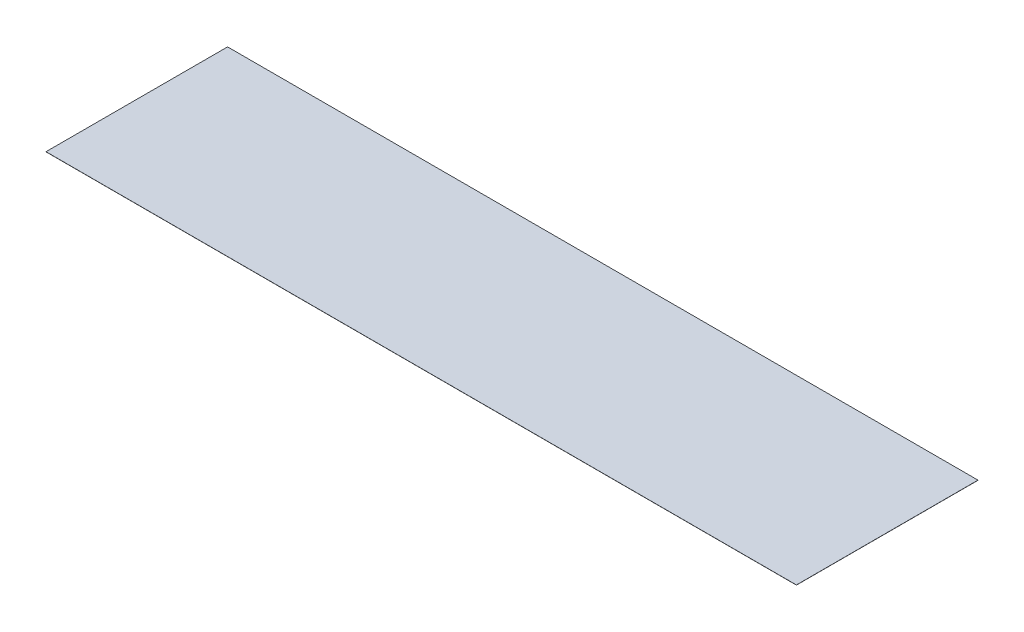
ISO-10303-21;
HEADER;
FILE_DESCRIPTION(('STEP AP214'),'2;1');
FILE_NAME('part.step','',(''),(''),'','','');
FILE_SCHEMA(('AUTOMOTIVE_DESIGN { 1 0 10303 214 1 1 1 1 }'));
ENDSEC;
DATA;
#1=APPLICATION_CONTEXT('core data for automotive mechanical design processes');
#2=APPLICATION_PROTOCOL_DEFINITION('international standard','automotive_design',2000,#1);
#3=PRODUCT_CONTEXT('',#1,'mechanical');
#4=PRODUCT('Part','Part','',(#3));
#5=PRODUCT_RELATED_PRODUCT_CATEGORY('part','',(#4));
#6=PRODUCT_DEFINITION_FORMATION('','',#4);
#7=PRODUCT_DEFINITION_CONTEXT('part definition',#1,'design');
#8=PRODUCT_DEFINITION('design','',#6,#7);
#9=PRODUCT_DEFINITION_SHAPE('','',#8);
#10=(LENGTH_UNIT() NAMED_UNIT(*) SI_UNIT(.MILLI.,.METRE.));
#11=(NAMED_UNIT(*) PLANE_ANGLE_UNIT() SI_UNIT($,.RADIAN.));
#12=(NAMED_UNIT(*) SI_UNIT($,.STERADIAN.) SOLID_ANGLE_UNIT());
#13=UNCERTAINTY_MEASURE_WITH_UNIT(LENGTH_MEASURE(1.E-05),#10,'distance_accuracy_value','');
#14=(GEOMETRIC_REPRESENTATION_CONTEXT(3) GLOBAL_UNCERTAINTY_ASSIGNED_CONTEXT((#13)) GLOBAL_UNIT_ASSIGNED_CONTEXT((#10,
#11,#12)) REPRESENTATION_CONTEXT('',''));
#15=CARTESIAN_POINT('',(0.,0.,0.));
#16=DIRECTION('',(0.,0.,1.));
#17=DIRECTION('',(1.,0.,0.));
#18=AXIS2_PLACEMENT_3D('',#15,#16,#17);
#19=CARTESIAN_POINT('',(0.,1.,-1219.2));
#20=DIRECTION('',(1.,0.,0.));
#21=DIRECTION('',(0.,0.,-1.));
#22=AXIS2_PLACEMENT_3D('',#19,#20,#21);
#23=PLANE('',#22);
#24=DIRECTION('',(0.,0.,1.));
#25=VECTOR('',#24,1.);
#26=CARTESIAN_POINT('',(0.,0.,-1219.2));
#27=LINE('',#26,#25);
#28=CARTESIAN_POINT('',(0.,0.,-1219.2));
#29=VERTEX_POINT('',#28);
#30=CARTESIAN_POINT('',(0.,0.,0.));
#31=VERTEX_POINT('',#30);
#32=EDGE_CURVE('E98',#29,#31,#27,.T.);
#33=ORIENTED_EDGE('',*,*,#32,.T.);
#34=DIRECTION('',(0.,-1.,0.));
#35=VECTOR('',#34,1.);
#36=CARTESIAN_POINT('',(0.,1.,0.));
#37=LINE('',#36,#35);
#38=CARTESIAN_POINT('',(0.,1.,0.));
#39=VERTEX_POINT('',#38);
#40=EDGE_CURVE('E11',#39,#31,#37,.T.);
#41=ORIENTED_EDGE('',*,*,#40,.F.);
#42=DIRECTION('',(0.,0.,1.));
#43=VECTOR('',#42,1.);
#44=CARTESIAN_POINT('',(0.,1.,-1219.2));
#45=LINE('',#44,#43);
#46=CARTESIAN_POINT('',(0.,1.,-1219.2));
#47=VERTEX_POINT('',#46);
#48=EDGE_CURVE('E86',#47,#39,#45,.T.);
#49=ORIENTED_EDGE('',*,*,#48,.F.);
#50=DIRECTION('',(0.,-1.,0.));
#51=VECTOR('',#50,1.);
#52=CARTESIAN_POINT('',(0.,1.,-1219.2));
#53=LINE('',#52,#51);
#54=EDGE_CURVE('E94',#47,#29,#53,.T.);
#55=ORIENTED_EDGE('',*,*,#54,.T.);
#56=EDGE_LOOP('',(#33,#41,#49,#55));
#57=FACE_BOUND('',#56,.T.);
#58=ADVANCED_FACE('F35',(#57),#23,.F.);
#59=CARTESIAN_POINT('',(0.,1.,0.));
#60=DIRECTION('',(0.,0.,-1.));
#61=DIRECTION('',(-1.,0.,0.));
#62=AXIS2_PLACEMENT_3D('',#59,#60,#61);
#63=PLANE('',#62);
#64=DIRECTION('',(1.,0.,0.));
#65=VECTOR('',#64,1.);
#66=CARTESIAN_POINT('',(0.,0.,0.));
#67=LINE('',#66,#65);
#68=CARTESIAN_POINT('',(5038.86075539473,0.,0.));
#69=VERTEX_POINT('',#68);
#70=EDGE_CURVE('E90',#31,#69,#67,.T.);
#71=ORIENTED_EDGE('',*,*,#70,.T.);
#72=DIRECTION('',(0.,-1.,0.));
#73=VECTOR('',#72,1.);
#74=CARTESIAN_POINT('',(5038.86075539473,1.,0.));
#75=LINE('',#74,#73);
#76=CARTESIAN_POINT('',(5038.86075539473,1.,0.));
#77=VERTEX_POINT('',#76);
#78=EDGE_CURVE('E43',#77,#69,#75,.T.);
#79=ORIENTED_EDGE('',*,*,#78,.F.);
#80=DIRECTION('',(1.,0.,0.));
#81=VECTOR('',#80,1.);
#82=CARTESIAN_POINT('',(0.,1.,0.));
#83=LINE('',#82,#81);
#84=EDGE_CURVE('E81',#39,#77,#83,.T.);
#85=ORIENTED_EDGE('',*,*,#84,.F.);
#86=ORIENTED_EDGE('',*,*,#40,.T.);
#87=EDGE_LOOP('',(#71,#79,#85,#86));
#88=FACE_BOUND('',#87,.T.);
#89=ADVANCED_FACE('F89',(#88),#63,.F.);
#90=CARTESIAN_POINT('',(5038.86075539473,1.,-1219.2));
#91=DIRECTION('',(-1.,0.,0.));
#92=DIRECTION('',(0.,0.,1.));
#93=AXIS2_PLACEMENT_3D('',#90,#91,#92);
#94=PLANE('',#93);
#95=DIRECTION('',(0.,0.,-1.));
#96=VECTOR('',#95,1.);
#97=CARTESIAN_POINT('',(5038.86075539473,0.,-1219.2));
#98=LINE('',#97,#96);
#99=CARTESIAN_POINT('',(5038.86075539473,0.,-1219.2));
#100=VERTEX_POINT('',#99);
#101=EDGE_CURVE('E68',#69,#100,#98,.T.);
#102=ORIENTED_EDGE('',*,*,#101,.T.);
#103=DIRECTION('',(0.,-1.,0.));
#104=VECTOR('',#103,1.);
#105=CARTESIAN_POINT('',(5038.86075539473,1.,-1219.2));
#106=LINE('',#105,#104);
#107=CARTESIAN_POINT('',(5038.86075539473,1.,-1219.2));
#108=VERTEX_POINT('',#107);
#109=EDGE_CURVE('E91',#108,#100,#106,.T.);
#110=ORIENTED_EDGE('',*,*,#109,.F.);
#111=DIRECTION('',(0.,0.,-1.));
#112=VECTOR('',#111,1.);
#113=CARTESIAN_POINT('',(5038.86075539473,1.,-1219.2));
#114=LINE('',#113,#112);
#115=EDGE_CURVE('E84',#77,#108,#114,.T.);
#116=ORIENTED_EDGE('',*,*,#115,.F.);
#117=ORIENTED_EDGE('',*,*,#78,.T.);
#118=EDGE_LOOP('',(#102,#110,#116,#117));
#119=FACE_BOUND('',#118,.T.);
#120=ADVANCED_FACE('F92',(#119),#94,.F.);
#121=CARTESIAN_POINT('',(0.,1.,-1219.2));
#122=DIRECTION('',(0.,0.,1.));
#123=DIRECTION('',(1.,0.,0.));
#124=AXIS2_PLACEMENT_3D('',#121,#122,#123);
#125=PLANE('',#124);
#126=DIRECTION('',(-1.,0.,0.));
#127=VECTOR('',#126,1.);
#128=CARTESIAN_POINT('',(0.,0.,-1219.2));
#129=LINE('',#128,#127);
#130=EDGE_CURVE('E74',#100,#29,#129,.T.);
#131=ORIENTED_EDGE('',*,*,#130,.T.);
#132=ORIENTED_EDGE('',*,*,#54,.F.);
#133=DIRECTION('',(-1.,0.,0.));
#134=VECTOR('',#133,1.);
#135=CARTESIAN_POINT('',(0.,1.,-1219.2));
#136=LINE('',#135,#134);
#137=EDGE_CURVE('E51',#108,#47,#136,.T.);
#138=ORIENTED_EDGE('',*,*,#137,.F.);
#139=ORIENTED_EDGE('',*,*,#109,.T.);
#140=EDGE_LOOP('',(#131,#132,#138,#139));
#141=FACE_BOUND('',#140,.T.);
#142=ADVANCED_FACE('F105',(#141),#125,.F.);
#143=CARTESIAN_POINT('',(0.,1.,0.));
#144=DIRECTION('',(0.,1.,0.));
#145=DIRECTION('',(0.,0.,1.));
#146=AXIS2_PLACEMENT_3D('',#143,#144,#145);
#147=PLANE('',#146);
#148=ORIENTED_EDGE('',*,*,#48,.T.);
#149=ORIENTED_EDGE('',*,*,#84,.T.);
#150=ORIENTED_EDGE('',*,*,#115,.T.);
#151=ORIENTED_EDGE('',*,*,#137,.T.);
#152=EDGE_LOOP('',(#148,#149,#150,#151));
#153=FACE_BOUND('',#152,.T.);
#154=ADVANCED_FACE('F82',(#153),#147,.T.);
#155=CARTESIAN_POINT('',(0.,0.,0.));
#156=DIRECTION('',(0.,1.,0.));
#157=DIRECTION('',(0.,0.,1.));
#158=AXIS2_PLACEMENT_3D('',#155,#156,#157);
#159=PLANE('',#158);
#160=ORIENTED_EDGE('',*,*,#32,.F.);
#161=ORIENTED_EDGE('',*,*,#130,.F.);
#162=ORIENTED_EDGE('',*,*,#101,.F.);
#163=ORIENTED_EDGE('',*,*,#70,.F.);
#164=EDGE_LOOP('',(#160,#161,#162,#163));
#165=FACE_BOUND('',#164,.T.);
#166=ADVANCED_FACE('F108',(#165),#159,.F.);
#167=CLOSED_SHELL('',(#58,#89,#120,#142,#154,#166));
#168=MANIFOLD_SOLID_BREP('B2',#167);
#169=ADVANCED_BREP_SHAPE_REPRESENTATION('',(#18,#168),#14);
#170=SHAPE_DEFINITION_REPRESENTATION(#9,#169);
ENDSEC;
END-ISO-10303-21;
